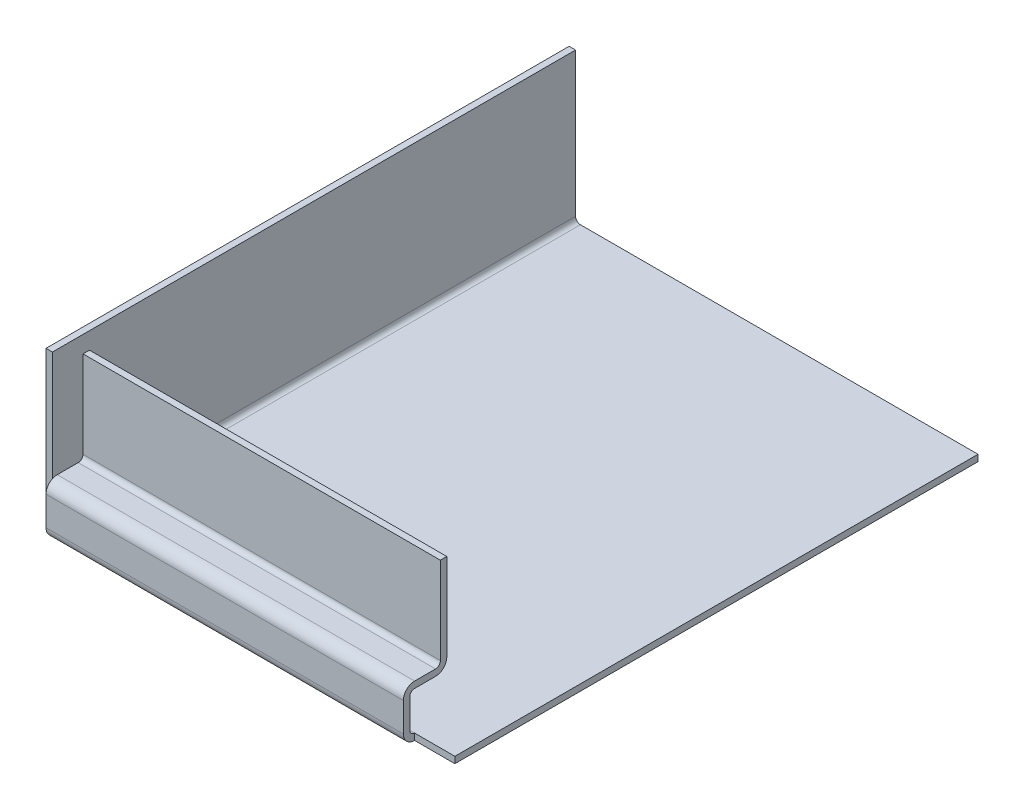
ISO-10303-21;
HEADER;
FILE_DESCRIPTION(('STEP AP214'),'2;1');
FILE_NAME('part.step','',(''),(''),'','','');
FILE_SCHEMA(('AUTOMOTIVE_DESIGN { 1 0 10303 214 1 1 1 1 }'));
ENDSEC;
DATA;
#1=APPLICATION_CONTEXT('core data for automotive mechanical design processes');
#2=APPLICATION_PROTOCOL_DEFINITION('international standard','automotive_design',2000,#1);
#3=PRODUCT_CONTEXT('',#1,'mechanical');
#4=PRODUCT('Part','Part','',(#3));
#5=PRODUCT_RELATED_PRODUCT_CATEGORY('part','',(#4));
#6=PRODUCT_DEFINITION_FORMATION('','',#4);
#7=PRODUCT_DEFINITION_CONTEXT('part definition',#1,'design');
#8=PRODUCT_DEFINITION('design','',#6,#7);
#9=PRODUCT_DEFINITION_SHAPE('','',#8);
#10=(LENGTH_UNIT() NAMED_UNIT(*) SI_UNIT(.MILLI.,.METRE.));
#11=(NAMED_UNIT(*) PLANE_ANGLE_UNIT() SI_UNIT($,.RADIAN.));
#12=(NAMED_UNIT(*) SI_UNIT($,.STERADIAN.) SOLID_ANGLE_UNIT());
#13=UNCERTAINTY_MEASURE_WITH_UNIT(LENGTH_MEASURE(1.E-05),#10,'distance_accuracy_value','');
#14=(GEOMETRIC_REPRESENTATION_CONTEXT(3) GLOBAL_UNCERTAINTY_ASSIGNED_CONTEXT((#13)) GLOBAL_UNIT_ASSIGNED_CONTEXT((#10,
#11,#12)) REPRESENTATION_CONTEXT('',''));
#15=CARTESIAN_POINT('',(0.,0.,0.));
#16=DIRECTION('',(0.,0.,1.));
#17=DIRECTION('',(1.,0.,0.));
#18=AXIS2_PLACEMENT_3D('',#15,#16,#17);
#19=CARTESIAN_POINT('',(0.,0.,57.));
#20=DIRECTION('',(0.,0.,1.));
#21=DIRECTION('',(0.,-1.,0.));
#22=AXIS2_PLACEMENT_3D('',#19,#20,#21);
#23=PLANE('',#22);
#24=DIRECTION('',(0.,1.,0.));
#25=VECTOR('',#24,1.);
#26=CARTESIAN_POINT('',(1.2,-2.99999999999996,57.));
#27=LINE('',#26,#25);
#28=CARTESIAN_POINT('',(1.20000000000001,-24.6,57.));
#29=VERTEX_POINT('',#28);
#30=CARTESIAN_POINT('',(1.20000000000001,-2.99999999999996,57.));
#31=VERTEX_POINT('',#30);
#32=EDGE_CURVE('E162',#29,#31,#27,.T.);
#33=ORIENTED_EDGE('',*,*,#32,.T.);
#34=DIRECTION('',(1.,0.,0.));
#35=VECTOR('',#34,1.);
#36=CARTESIAN_POINT('',(90.,-2.99999999999996,57.));
#37=LINE('',#36,#35);
#38=CARTESIAN_POINT('',(90.,-2.99999999999996,57.));
#39=VERTEX_POINT('',#38);
#40=EDGE_CURVE('E189',#31,#39,#37,.T.);
#41=ORIENTED_EDGE('',*,*,#40,.T.);
#42=DIRECTION('',(0.,1.,0.));
#43=VECTOR('',#42,1.);
#44=CARTESIAN_POINT('',(90.,-25.8,57.));
#45=LINE('',#44,#43);
#46=CARTESIAN_POINT('',(90.,-24.6,57.));
#47=VERTEX_POINT('',#46);
#48=EDGE_CURVE('E200',#39,#47,#45,.F.);
#49=ORIENTED_EDGE('',*,*,#48,.T.);
#50=DIRECTION('',(-1.,0.,0.));
#51=VECTOR('',#50,1.);
#52=CARTESIAN_POINT('',(1.20000000000001,-24.6,57.));
#53=LINE('',#52,#51);
#54=EDGE_CURVE('E167',#29,#47,#53,.F.);
#55=ORIENTED_EDGE('',*,*,#54,.F.);
#56=EDGE_LOOP('',(#33,#41,#49,#55));
#57=FACE_BOUND('',#56,.T.);
#58=ADVANCED_FACE('F17',(#57),#23,.F.);
#59=CARTESIAN_POINT('',(90.,-2.99999999999996,57.));
#60=DIRECTION('',(0.,-1.,0.));
#61=DIRECTION('',(0.,0.,-1.));
#62=AXIS2_PLACEMENT_3D('',#59,#60,#61);
#63=PLANE('',#62);
#64=DIRECTION('',(0.,0.,-1.));
#65=VECTOR('',#64,1.);
#66=CARTESIAN_POINT('',(90.,-2.99999999999996,57.));
#67=LINE('',#66,#65);
#68=CARTESIAN_POINT('',(90.,-2.99999999999996,58.6));
#69=VERTEX_POINT('',#68);
#70=EDGE_CURVE('E186',#39,#69,#67,.F.);
#71=ORIENTED_EDGE('',*,*,#70,.F.);
#72=ORIENTED_EDGE('',*,*,#40,.F.);
#73=DIRECTION('',(0.,0.,-1.));
#74=VECTOR('',#73,1.);
#75=CARTESIAN_POINT('',(1.20000000000001,-2.99999999999996,57.));
#76=LINE('',#75,#74);
#77=CARTESIAN_POINT('',(1.20000000000001,-2.99999999999996,58.6));
#78=VERTEX_POINT('',#77);
#79=EDGE_CURVE('E198',#78,#31,#76,.T.);
#80=ORIENTED_EDGE('',*,*,#79,.F.);
#81=DIRECTION('',(1.,0.,0.));
#82=VECTOR('',#81,1.);
#83=CARTESIAN_POINT('',(0.,-2.99999999999996,58.6));
#84=LINE('',#83,#82);
#85=EDGE_CURVE('E192',#69,#78,#84,.F.);
#86=ORIENTED_EDGE('',*,*,#85,.F.);
#87=EDGE_LOOP('',(#71,#72,#80,#86));
#88=FACE_BOUND('',#87,.T.);
#89=ADVANCED_FACE('F271',(#88),#63,.F.);
#90=CARTESIAN_POINT('',(1.20000000000001,-24.6,59.8));
#91=DIRECTION('',(-1.,0.,0.));
#92=DIRECTION('',(0.,0.,1.));
#93=AXIS2_PLACEMENT_3D('',#90,#91,#92);
#94=CYLINDRICAL_SURFACE('',#93,2.8);
#95=ORIENTED_EDGE('',*,*,#54,.T.);
#96=CARTESIAN_POINT('',(90.,-24.6,59.8));
#97=DIRECTION('',(-1.,0.,0.));
#98=DIRECTION('',(0.,0.,1.));
#99=AXIS2_PLACEMENT_3D('',#96,#97,#98);
#100=CIRCLE('',#99,2.8);
#101=CARTESIAN_POINT('',(90.,-27.4,59.8));
#102=VERTEX_POINT('',#101);
#103=EDGE_CURVE('E171',#102,#47,#100,.F.);
#104=ORIENTED_EDGE('',*,*,#103,.F.);
#105=DIRECTION('',(1.,0.,0.));
#106=VECTOR('',#105,1.);
#107=CARTESIAN_POINT('',(0.,-27.4,59.8));
#108=LINE('',#107,#106);
#109=CARTESIAN_POINT('',(1.20000000000001,-27.4,59.8));
#110=VERTEX_POINT('',#109);
#111=EDGE_CURVE('E169',#102,#110,#108,.F.);
#112=ORIENTED_EDGE('',*,*,#111,.T.);
#113=CARTESIAN_POINT('',(1.20000000000001,-24.6,59.8));
#114=DIRECTION('',(-1.,0.,0.));
#115=DIRECTION('',(0.,0.,1.));
#116=AXIS2_PLACEMENT_3D('',#113,#114,#115);
#117=CIRCLE('',#116,2.8);
#118=EDGE_CURVE('E20',#110,#29,#117,.F.);
#119=ORIENTED_EDGE('',*,*,#118,.T.);
#120=EDGE_LOOP('',(#95,#104,#112,#119));
#121=FACE_BOUND('',#120,.T.);
#122=ADVANCED_FACE('F170',(#121),#94,.T.);
#123=CARTESIAN_POINT('',(0.,0.,58.6));
#124=DIRECTION('',(0.,0.,1.));
#125=DIRECTION('',(0.,-1.,0.));
#126=AXIS2_PLACEMENT_3D('',#123,#124,#125);
#127=PLANE('',#126);
#128=DIRECTION('',(0.,-1.,0.));
#129=VECTOR('',#128,1.);
#130=CARTESIAN_POINT('',(90.,0.,58.6));
#131=LINE('',#130,#129);
#132=CARTESIAN_POINT('',(90.,-24.6,58.6));
#133=VERTEX_POINT('',#132);
#134=EDGE_CURVE('E195',#133,#69,#131,.F.);
#135=ORIENTED_EDGE('',*,*,#134,.T.);
#136=ORIENTED_EDGE('',*,*,#85,.T.);
#137=DIRECTION('',(0.,-1.,0.));
#138=VECTOR('',#137,1.);
#139=CARTESIAN_POINT('',(1.20000000000001,0.,58.6));
#140=LINE('',#139,#138);
#141=CARTESIAN_POINT('',(1.20000000000001,-24.6,58.6));
#142=VERTEX_POINT('',#141);
#143=EDGE_CURVE('E166',#78,#142,#140,.T.);
#144=ORIENTED_EDGE('',*,*,#143,.T.);
#145=DIRECTION('',(-1.,0.,0.));
#146=VECTOR('',#145,1.);
#147=CARTESIAN_POINT('',(1.20000000000001,-24.6,58.6));
#148=LINE('',#147,#146);
#149=EDGE_CURVE('E261',#142,#133,#148,.F.);
#150=ORIENTED_EDGE('',*,*,#149,.T.);
#151=EDGE_LOOP('',(#135,#136,#144,#150));
#152=FACE_BOUND('',#151,.T.);
#153=ADVANCED_FACE('F447',(#152),#127,.T.);
#154=CARTESIAN_POINT('',(0.,-27.3999999999998,0.));
#155=DIRECTION('',(0.,1.,0.));
#156=DIRECTION('',(0.,0.,1.));
#157=AXIS2_PLACEMENT_3D('',#154,#155,#156);
#158=PLANE('',#157);
#159=DIRECTION('',(0.,0.,1.));
#160=VECTOR('',#159,1.);
#161=CARTESIAN_POINT('',(1.2,-27.4,59.8));
#162=LINE('',#161,#160);
#163=CARTESIAN_POINT('',(1.20000000000001,-27.4,65.));
#164=VERTEX_POINT('',#163);
#165=EDGE_CURVE('E159',#110,#164,#162,.T.);
#166=ORIENTED_EDGE('',*,*,#165,.F.);
#167=ORIENTED_EDGE('',*,*,#111,.F.);
#168=DIRECTION('',(0.,0.,-1.));
#169=VECTOR('',#168,1.);
#170=CARTESIAN_POINT('',(90.,-27.4,66.2));
#171=LINE('',#170,#169);
#172=CARTESIAN_POINT('',(90.,-27.4,65.));
#173=VERTEX_POINT('',#172);
#174=EDGE_CURVE('E179',#173,#102,#171,.T.);
#175=ORIENTED_EDGE('',*,*,#174,.F.);
#176=DIRECTION('',(1.,0.,0.));
#177=VECTOR('',#176,1.);
#178=CARTESIAN_POINT('',(90.,-27.4,65.));
#179=LINE('',#178,#177);
#180=EDGE_CURVE('E178',#173,#164,#179,.F.);
#181=ORIENTED_EDGE('',*,*,#180,.T.);
#182=EDGE_LOOP('',(#166,#167,#175,#181));
#183=FACE_BOUND('',#182,.T.);
#184=ADVANCED_FACE('F177',(#183),#158,.F.);
#185=CARTESIAN_POINT('',(1.20000000000001,-24.6,59.8));
#186=DIRECTION('',(-1.,0.,0.));
#187=DIRECTION('',(0.,0.,1.));
#188=AXIS2_PLACEMENT_3D('',#185,#186,#187);
#189=CYLINDRICAL_SURFACE('',#188,1.2);
#190=CARTESIAN_POINT('',(90.,-24.6,59.8));
#191=DIRECTION('',(-1.,0.,0.));
#192=DIRECTION('',(0.,0.,1.));
#193=AXIS2_PLACEMENT_3D('',#190,#191,#192);
#194=CIRCLE('',#193,1.2);
#195=CARTESIAN_POINT('',(90.,-25.8,59.8));
#196=VERTEX_POINT('',#195);
#197=EDGE_CURVE('E258',#133,#196,#194,.T.);
#198=ORIENTED_EDGE('',*,*,#197,.F.);
#199=ORIENTED_EDGE('',*,*,#149,.F.);
#200=CARTESIAN_POINT('',(1.20000000000001,-24.6,59.8));
#201=DIRECTION('',(-1.,0.,0.));
#202=DIRECTION('',(0.,0.,1.));
#203=AXIS2_PLACEMENT_3D('',#200,#201,#202);
#204=CIRCLE('',#203,1.2);
#205=CARTESIAN_POINT('',(1.20000000000001,-25.8,59.8));
#206=VERTEX_POINT('',#205);
#207=EDGE_CURVE('E181',#206,#142,#204,.F.);
#208=ORIENTED_EDGE('',*,*,#207,.F.);
#209=DIRECTION('',(1.,0.,0.));
#210=VECTOR('',#209,1.);
#211=CARTESIAN_POINT('',(0.,-25.8,59.8));
#212=LINE('',#211,#210);
#213=EDGE_CURVE('E253',#196,#206,#212,.F.);
#214=ORIENTED_EDGE('',*,*,#213,.F.);
#215=EDGE_LOOP('',(#198,#199,#208,#214));
#216=FACE_BOUND('',#215,.T.);
#217=ADVANCED_FACE('F446',(#216),#189,.F.);
#218=CARTESIAN_POINT('',(90.,-28.6,65.));
#219=DIRECTION('',(1.,0.,0.));
#220=DIRECTION('',(0.,0.,-1.));
#221=AXIS2_PLACEMENT_3D('',#218,#219,#220);
#222=CYLINDRICAL_SURFACE('',#221,1.2);
#223=CARTESIAN_POINT('',(1.20000000000001,-28.6,65.));
#224=DIRECTION('',(1.,0.,0.));
#225=DIRECTION('',(0.,0.,-1.));
#226=AXIS2_PLACEMENT_3D('',#223,#224,#225);
#227=CIRCLE('',#226,1.2);
#228=CARTESIAN_POINT('',(1.20000000000001,-28.6,66.2));
#229=VERTEX_POINT('',#228);
#230=EDGE_CURVE('E250',#164,#229,#227,.T.);
#231=ORIENTED_EDGE('',*,*,#230,.F.);
#232=ORIENTED_EDGE('',*,*,#180,.F.);
#233=CARTESIAN_POINT('',(90.,-28.6,65.));
#234=DIRECTION('',(1.,0.,0.));
#235=DIRECTION('',(0.,0.,-1.));
#236=AXIS2_PLACEMENT_3D('',#233,#234,#235);
#237=CIRCLE('',#236,1.2);
#238=CARTESIAN_POINT('',(90.,-28.6,66.2));
#239=VERTEX_POINT('',#238);
#240=EDGE_CURVE('E254',#173,#239,#237,.T.);
#241=ORIENTED_EDGE('',*,*,#240,.T.);
#242=DIRECTION('',(-1.,0.,0.));
#243=VECTOR('',#242,1.);
#244=CARTESIAN_POINT('',(0.,-28.6,66.2));
#245=LINE('',#244,#243);
#246=EDGE_CURVE('E252',#229,#239,#245,.F.);
#247=ORIENTED_EDGE('',*,*,#246,.F.);
#248=EDGE_LOOP('',(#231,#232,#241,#247));
#249=FACE_BOUND('',#248,.T.);
#250=ADVANCED_FACE('F432',(#249),#222,.F.);
#251=CARTESIAN_POINT('',(0.,-25.7999999999998,0.));
#252=DIRECTION('',(0.,1.,0.));
#253=DIRECTION('',(0.,0.,1.));
#254=AXIS2_PLACEMENT_3D('',#251,#252,#253);
#255=PLANE('',#254);
#256=DIRECTION('',(0.,0.,1.));
#257=VECTOR('',#256,1.);
#258=CARTESIAN_POINT('',(90.,-25.7999999999998,0.));
#259=LINE('',#258,#257);
#260=CARTESIAN_POINT('',(90.,-25.8,65.));
#261=VERTEX_POINT('',#260);
#262=EDGE_CURVE('E287',#261,#196,#259,.F.);
#263=ORIENTED_EDGE('',*,*,#262,.T.);
#264=ORIENTED_EDGE('',*,*,#213,.T.);
#265=DIRECTION('',(0.,0.,1.));
#266=VECTOR('',#265,1.);
#267=CARTESIAN_POINT('',(1.20000000000001,-25.7999999999998,0.));
#268=LINE('',#267,#266);
#269=CARTESIAN_POINT('',(1.20000000000001,-25.8,65.));
#270=VERTEX_POINT('',#269);
#271=EDGE_CURVE('E257',#206,#270,#268,.T.);
#272=ORIENTED_EDGE('',*,*,#271,.T.);
#273=DIRECTION('',(1.,0.,0.));
#274=VECTOR('',#273,1.);
#275=CARTESIAN_POINT('',(90.,-25.8,65.));
#276=LINE('',#275,#274);
#277=EDGE_CURVE('E246',#261,#270,#276,.F.);
#278=ORIENTED_EDGE('',*,*,#277,.F.);
#279=EDGE_LOOP('',(#263,#264,#272,#278));
#280=FACE_BOUND('',#279,.T.);
#281=ADVANCED_FACE('F442',(#280),#255,.T.);
#282=CARTESIAN_POINT('',(0.,0.,65.));
#283=DIRECTION('',(1.,0.,0.));
#284=DIRECTION('',(0.,1.,0.));
#285=AXIS2_PLACEMENT_3D('',#282,#283,#284);
#286=PLANE('',#285);
#287=DIRECTION('',(0.,1.,0.));
#288=VECTOR('',#287,1.);
#289=CARTESIAN_POINT('',(0.,-35.8,65.));
#290=LINE('',#289,#288);
#291=CARTESIAN_POINT('',(0.,0.,65.));
#292=VERTEX_POINT('',#291);
#293=CARTESIAN_POINT('',(0.,-35.8,65.));
#294=VERTEX_POINT('',#293);
#295=EDGE_CURVE('E307',#292,#294,#290,.F.);
#296=ORIENTED_EDGE('',*,*,#295,.T.);
#297=DIRECTION('',(0.,0.,-1.));
#298=VECTOR('',#297,1.);
#299=CARTESIAN_POINT('',(0.,-35.8,65.));
#300=LINE('',#299,#298);
#301=CARTESIAN_POINT('',(0.,-35.8,-65.));
#302=VERTEX_POINT('',#301);
#303=EDGE_CURVE('E311',#294,#302,#300,.T.);
#304=ORIENTED_EDGE('',*,*,#303,.T.);
#305=DIRECTION('',(0.,1.,0.));
#306=VECTOR('',#305,1.);
#307=CARTESIAN_POINT('',(0.,-38.6,-65.));
#308=LINE('',#307,#306);
#309=CARTESIAN_POINT('',(0.,0.,-65.));
#310=VERTEX_POINT('',#309);
#311=EDGE_CURVE('E305',#310,#302,#308,.F.);
#312=ORIENTED_EDGE('',*,*,#311,.F.);
#313=DIRECTION('',(0.,0.,1.));
#314=VECTOR('',#313,1.);
#315=CARTESIAN_POINT('',(0.,0.,65.));
#316=LINE('',#315,#314);
#317=EDGE_CURVE('E291',#292,#310,#316,.F.);
#318=ORIENTED_EDGE('',*,*,#317,.F.);
#319=EDGE_LOOP('',(#296,#304,#312,#318));
#320=FACE_BOUND('',#319,.T.);
#321=ADVANCED_FACE('F411',(#320),#286,.T.);
#322=CARTESIAN_POINT('',(0.,0.,66.2));
#323=DIRECTION('',(0.,0.,-1.));
#324=DIRECTION('',(-1.,0.,0.));
#325=AXIS2_PLACEMENT_3D('',#322,#323,#324);
#326=PLANE('',#325);
#327=DIRECTION('',(0.,1.,0.));
#328=VECTOR('',#327,1.);
#329=CARTESIAN_POINT('',(1.2,-37.,66.2));
#330=LINE('',#329,#328);
#331=CARTESIAN_POINT('',(1.20000000000001,-35.8,66.2));
#332=VERTEX_POINT('',#331);
#333=EDGE_CURVE('E249',#332,#229,#330,.T.);
#334=ORIENTED_EDGE('',*,*,#333,.T.);
#335=ORIENTED_EDGE('',*,*,#246,.T.);
#336=DIRECTION('',(0.,1.,0.));
#337=VECTOR('',#336,1.);
#338=CARTESIAN_POINT('',(90.,-28.6,66.2));
#339=LINE('',#338,#337);
#340=CARTESIAN_POINT('',(90.,-35.8,66.2));
#341=VERTEX_POINT('',#340);
#342=EDGE_CURVE('E245',#239,#341,#339,.F.);
#343=ORIENTED_EDGE('',*,*,#342,.T.);
#344=DIRECTION('',(1.,0.,0.));
#345=VECTOR('',#344,1.);
#346=CARTESIAN_POINT('',(90.,-35.8,66.2));
#347=LINE('',#346,#345);
#348=EDGE_CURVE('E242',#341,#332,#347,.F.);
#349=ORIENTED_EDGE('',*,*,#348,.T.);
#350=EDGE_LOOP('',(#334,#335,#343,#349));
#351=FACE_BOUND('',#350,.T.);
#352=ADVANCED_FACE('F430',(#351),#326,.T.);
#353=CARTESIAN_POINT('',(-1.6,0.,65.));
#354=DIRECTION('',(0.,1.,0.));
#355=DIRECTION('',(-1.,0.,0.));
#356=AXIS2_PLACEMENT_3D('',#353,#354,#355);
#357=PLANE('',#356);
#358=DIRECTION('',(-1.,0.,0.));
#359=VECTOR('',#358,1.);
#360=CARTESIAN_POINT('',(1.2,0.,65.));
#361=LINE('',#360,#359);
#362=CARTESIAN_POINT('',(-1.6,0.,65.));
#363=VERTEX_POINT('',#362);
#364=EDGE_CURVE('E293',#363,#292,#361,.F.);
#365=ORIENTED_EDGE('',*,*,#364,.T.);
#366=ORIENTED_EDGE('',*,*,#317,.T.);
#367=DIRECTION('',(-1.,0.,0.));
#368=VECTOR('',#367,1.);
#369=CARTESIAN_POINT('',(1.2,0.,-65.));
#370=LINE('',#369,#368);
#371=CARTESIAN_POINT('',(-1.6,0.,-65.));
#372=VERTEX_POINT('',#371);
#373=EDGE_CURVE('E296',#372,#310,#370,.F.);
#374=ORIENTED_EDGE('',*,*,#373,.F.);
#375=DIRECTION('',(0.,0.,1.));
#376=VECTOR('',#375,1.);
#377=CARTESIAN_POINT('',(-1.6,0.,65.));
#378=LINE('',#377,#376);
#379=EDGE_CURVE('E239',#372,#363,#378,.T.);
#380=ORIENTED_EDGE('',*,*,#379,.T.);
#381=EDGE_LOOP('',(#365,#366,#374,#380));
#382=FACE_BOUND('',#381,.T.);
#383=ADVANCED_FACE('F408',(#382),#357,.T.);
#384=CARTESIAN_POINT('',(90.,-28.6,65.));
#385=DIRECTION('',(1.,0.,0.));
#386=DIRECTION('',(0.,0.,-1.));
#387=AXIS2_PLACEMENT_3D('',#384,#385,#386);
#388=CYLINDRICAL_SURFACE('',#387,2.8);
#389=ORIENTED_EDGE('',*,*,#277,.T.);
#390=CARTESIAN_POINT('',(1.20000000000001,-28.6,65.));
#391=DIRECTION('',(1.,0.,0.));
#392=DIRECTION('',(0.,0.,-1.));
#393=AXIS2_PLACEMENT_3D('',#390,#391,#392);
#394=CIRCLE('',#393,2.8);
#395=CARTESIAN_POINT('',(1.20000000000001,-28.6,67.8));
#396=VERTEX_POINT('',#395);
#397=EDGE_CURVE('E243',#270,#396,#394,.T.);
#398=ORIENTED_EDGE('',*,*,#397,.T.);
#399=DIRECTION('',(-1.,0.,0.));
#400=VECTOR('',#399,1.);
#401=CARTESIAN_POINT('',(0.,-28.6,67.8));
#402=LINE('',#401,#400);
#403=CARTESIAN_POINT('',(90.,-28.6,67.8));
#404=VERTEX_POINT('',#403);
#405=EDGE_CURVE('E336',#396,#404,#402,.F.);
#406=ORIENTED_EDGE('',*,*,#405,.T.);
#407=CARTESIAN_POINT('',(90.,-28.6,65.));
#408=DIRECTION('',(1.,0.,0.));
#409=DIRECTION('',(0.,0.,-1.));
#410=AXIS2_PLACEMENT_3D('',#407,#408,#409);
#411=CIRCLE('',#410,2.8);
#412=EDGE_CURVE('E247',#404,#261,#411,.F.);
#413=ORIENTED_EDGE('',*,*,#412,.T.);
#414=EDGE_LOOP('',(#389,#398,#406,#413));
#415=FACE_BOUND('',#414,.T.);
#416=ADVANCED_FACE('F438',(#415),#388,.T.);
#417=CARTESIAN_POINT('',(1.2,-35.8,65.));
#418=DIRECTION('',(0.,0.,-1.));
#419=DIRECTION('',(-1.,0.,0.));
#420=AXIS2_PLACEMENT_3D('',#417,#418,#419);
#421=CYLINDRICAL_SURFACE('',#420,1.2);
#422=ORIENTED_EDGE('',*,*,#303,.F.);
#423=CARTESIAN_POINT('',(1.2,-35.8,65.));
#424=DIRECTION('',(0.,0.,-1.));
#425=DIRECTION('',(-1.,0.,0.));
#426=AXIS2_PLACEMENT_3D('',#423,#424,#425);
#427=CIRCLE('',#426,1.2);
#428=CARTESIAN_POINT('',(1.20000000000001,-37.,65.));
#429=VERTEX_POINT('',#428);
#430=EDGE_CURVE('E236',#429,#294,#427,.T.);
#431=ORIENTED_EDGE('',*,*,#430,.F.);
#432=DIRECTION('',(0.,0.,1.));
#433=VECTOR('',#432,1.);
#434=CARTESIAN_POINT('',(1.2,-37.,65.));
#435=LINE('',#434,#433);
#436=CARTESIAN_POINT('',(1.2,-37.,-65.));
#437=VERTEX_POINT('',#436);
#438=EDGE_CURVE('E341',#437,#429,#435,.T.);
#439=ORIENTED_EDGE('',*,*,#438,.F.);
#440=CARTESIAN_POINT('',(1.2,-35.8,-65.));
#441=DIRECTION('',(0.,0.,-1.));
#442=DIRECTION('',(-1.,0.,0.));
#443=AXIS2_PLACEMENT_3D('',#440,#441,#442);
#444=CIRCLE('',#443,1.2);
#445=EDGE_CURVE('E240',#302,#437,#444,.F.);
#446=ORIENTED_EDGE('',*,*,#445,.F.);
#447=EDGE_LOOP('',(#422,#431,#439,#446));
#448=FACE_BOUND('',#447,.T.);
#449=ADVANCED_FACE('F418',(#448),#421,.F.);
#450=CARTESIAN_POINT('',(90.,-35.8,65.));
#451=DIRECTION('',(1.,0.,0.));
#452=DIRECTION('',(0.,0.,-1.));
#453=AXIS2_PLACEMENT_3D('',#450,#451,#452);
#454=CYLINDRICAL_SURFACE('',#453,1.19999999999999);
#455=CARTESIAN_POINT('',(1.20000000000001,-35.8,65.));
#456=DIRECTION('',(1.,0.,0.));
#457=DIRECTION('',(0.,0.,-1.));
#458=AXIS2_PLACEMENT_3D('',#455,#456,#457);
#459=CIRCLE('',#458,1.19999999999999);
#460=EDGE_CURVE('E227',#332,#429,#459,.T.);
#461=ORIENTED_EDGE('',*,*,#460,.F.);
#462=ORIENTED_EDGE('',*,*,#348,.F.);
#463=CARTESIAN_POINT('',(90.,-35.8,65.));
#464=DIRECTION('',(1.,0.,0.));
#465=DIRECTION('',(0.,0.,-1.));
#466=AXIS2_PLACEMENT_3D('',#463,#464,#465);
#467=CIRCLE('',#466,1.19999999999999);
#468=CARTESIAN_POINT('',(90.,-37.,65.));
#469=VERTEX_POINT('',#468);
#470=EDGE_CURVE('E231',#341,#469,#467,.T.);
#471=ORIENTED_EDGE('',*,*,#470,.T.);
#472=DIRECTION('',(1.,0.,0.));
#473=VECTOR('',#472,1.);
#474=CARTESIAN_POINT('',(0.,-37.,65.));
#475=LINE('',#474,#473);
#476=EDGE_CURVE('E226',#429,#469,#475,.T.);
#477=ORIENTED_EDGE('',*,*,#476,.F.);
#478=EDGE_LOOP('',(#461,#462,#471,#477));
#479=FACE_BOUND('',#478,.T.);
#480=ADVANCED_FACE('F427',(#479),#454,.F.);
#481=CARTESIAN_POINT('',(1.2,-37.,65.));
#482=DIRECTION('',(0.,0.,1.));
#483=DIRECTION('',(1.,0.,0.));
#484=AXIS2_PLACEMENT_3D('',#481,#482,#483);
#485=PLANE('',#484);
#486=ORIENTED_EDGE('',*,*,#430,.T.);
#487=ORIENTED_EDGE('',*,*,#295,.F.);
#488=ORIENTED_EDGE('',*,*,#364,.F.);
#489=DIRECTION('',(0.,1.,0.));
#490=VECTOR('',#489,1.);
#491=CARTESIAN_POINT('',(-1.6,0.,65.));
#492=LINE('',#491,#490);
#493=CARTESIAN_POINT('',(-1.6,-35.8,65.));
#494=VERTEX_POINT('',#493);
#495=EDGE_CURVE('E326',#363,#494,#492,.F.);
#496=ORIENTED_EDGE('',*,*,#495,.T.);
#497=CARTESIAN_POINT('',(1.2,-35.8,65.));
#498=DIRECTION('',(0.,0.,-1.));
#499=DIRECTION('',(-1.,0.,0.));
#500=AXIS2_PLACEMENT_3D('',#497,#498,#499);
#501=CIRCLE('',#500,2.8);
#502=CARTESIAN_POINT('',(1.20000000000001,-38.6,65.));
#503=VERTEX_POINT('',#502);
#504=EDGE_CURVE('E222',#503,#494,#501,.T.);
#505=ORIENTED_EDGE('',*,*,#504,.F.);
#506=DIRECTION('',(0.,1.,0.));
#507=VECTOR('',#506,1.);
#508=CARTESIAN_POINT('',(1.20000000000001,-35.8,65.));
#509=LINE('',#508,#507);
#510=EDGE_CURVE('E229',#429,#503,#509,.F.);
#511=ORIENTED_EDGE('',*,*,#510,.F.);
#512=EDGE_LOOP('',(#486,#487,#488,#496,#505,#511));
#513=FACE_BOUND('',#512,.T.);
#514=ADVANCED_FACE('F413',(#513),#485,.T.);
#515=CARTESIAN_POINT('',(-1.6,0.,65.));
#516=DIRECTION('',(1.,0.,0.));
#517=DIRECTION('',(0.,1.,0.));
#518=AXIS2_PLACEMENT_3D('',#515,#516,#517);
#519=PLANE('',#518);
#520=DIRECTION('',(0.,0.,-1.));
#521=VECTOR('',#520,1.);
#522=CARTESIAN_POINT('',(-1.6,-35.8,65.));
#523=LINE('',#522,#521);
#524=CARTESIAN_POINT('',(-1.6,-35.8,-65.));
#525=VERTEX_POINT('',#524);
#526=EDGE_CURVE('E221',#494,#525,#523,.T.);
#527=ORIENTED_EDGE('',*,*,#526,.F.);
#528=ORIENTED_EDGE('',*,*,#495,.F.);
#529=ORIENTED_EDGE('',*,*,#379,.F.);
#530=DIRECTION('',(0.,1.,0.));
#531=VECTOR('',#530,1.);
#532=CARTESIAN_POINT('',(-1.6,0.,-65.));
#533=LINE('',#532,#531);
#534=EDGE_CURVE('E348',#525,#372,#533,.T.);
#535=ORIENTED_EDGE('',*,*,#534,.F.);
#536=EDGE_LOOP('',(#527,#528,#529,#535));
#537=FACE_BOUND('',#536,.T.);
#538=ADVANCED_FACE('F405',(#537),#519,.F.);
#539=CARTESIAN_POINT('',(90.,-35.8,65.));
#540=DIRECTION('',(-1.,0.,0.));
#541=DIRECTION('',(0.,0.,1.));
#542=AXIS2_PLACEMENT_3D('',#539,#540,#541);
#543=PLANE('',#542);
#544=ORIENTED_EDGE('',*,*,#470,.F.);
#545=ORIENTED_EDGE('',*,*,#342,.F.);
#546=ORIENTED_EDGE('',*,*,#240,.F.);
#547=ORIENTED_EDGE('',*,*,#174,.T.);
#548=ORIENTED_EDGE('',*,*,#103,.T.);
#549=ORIENTED_EDGE('',*,*,#48,.F.);
#550=ORIENTED_EDGE('',*,*,#70,.T.);
#551=ORIENTED_EDGE('',*,*,#134,.F.);
#552=ORIENTED_EDGE('',*,*,#197,.T.);
#553=ORIENTED_EDGE('',*,*,#262,.F.);
#554=ORIENTED_EDGE('',*,*,#412,.F.);
#555=DIRECTION('',(0.,1.,0.));
#556=VECTOR('',#555,1.);
#557=CARTESIAN_POINT('',(90.,0.,67.8));
#558=LINE('',#557,#556);
#559=CARTESIAN_POINT('',(90.,-35.8,67.8));
#560=VERTEX_POINT('',#559);
#561=EDGE_CURVE('E230',#404,#560,#558,.F.);
#562=ORIENTED_EDGE('',*,*,#561,.T.);
#563=CARTESIAN_POINT('',(90.,-35.8,65.));
#564=DIRECTION('',(1.,0.,0.));
#565=DIRECTION('',(0.,0.,-1.));
#566=AXIS2_PLACEMENT_3D('',#563,#564,#565);
#567=CIRCLE('',#566,2.8);
#568=CARTESIAN_POINT('',(90.,-38.6,65.));
#569=VERTEX_POINT('',#568);
#570=EDGE_CURVE('E219',#569,#560,#567,.F.);
#571=ORIENTED_EDGE('',*,*,#570,.F.);
#572=DIRECTION('',(0.,1.,0.));
#573=VECTOR('',#572,1.);
#574=CARTESIAN_POINT('',(90.,-35.8,65.));
#575=LINE('',#574,#573);
#576=EDGE_CURVE('E235',#469,#569,#575,.F.);
#577=ORIENTED_EDGE('',*,*,#576,.F.);
#578=EDGE_LOOP('',(#544,#545,#546,#547,#548,#549,#550,#551,#552,#553,#554,#562,#571,#577));
#579=FACE_BOUND('',#578,.T.);
#580=ADVANCED_FACE('F265',(#579),#543,.F.);
#581=CARTESIAN_POINT('',(0.,0.,67.8));
#582=DIRECTION('',(0.,0.,-1.));
#583=DIRECTION('',(-1.,0.,0.));
#584=AXIS2_PLACEMENT_3D('',#581,#582,#583);
#585=PLANE('',#584);
#586=ORIENTED_EDGE('',*,*,#561,.F.);
#587=ORIENTED_EDGE('',*,*,#405,.F.);
#588=DIRECTION('',(0.,1.,0.));
#589=VECTOR('',#588,1.);
#590=CARTESIAN_POINT('',(1.20000000000001,0.,67.8));
#591=LINE('',#590,#589);
#592=CARTESIAN_POINT('',(1.20000000000001,-35.8,67.8));
#593=VERTEX_POINT('',#592);
#594=EDGE_CURVE('E234',#593,#396,#591,.T.);
#595=ORIENTED_EDGE('',*,*,#594,.F.);
#596=DIRECTION('',(1.,0.,0.));
#597=VECTOR('',#596,1.);
#598=CARTESIAN_POINT('',(90.,-35.8,67.8));
#599=LINE('',#598,#597);
#600=EDGE_CURVE('E218',#560,#593,#599,.F.);
#601=ORIENTED_EDGE('',*,*,#600,.F.);
#602=EDGE_LOOP('',(#586,#587,#595,#601));
#603=FACE_BOUND('',#602,.T.);
#604=ADVANCED_FACE('F436',(#603),#585,.F.);
#605=CARTESIAN_POINT('',(1.20000000000001,-35.8,65.));
#606=DIRECTION('',(-1.,0.,0.));
#607=DIRECTION('',(0.,0.,1.));
#608=AXIS2_PLACEMENT_3D('',#605,#606,#607);
#609=PLANE('',#608);
#610=ORIENTED_EDGE('',*,*,#510,.T.);
#611=CARTESIAN_POINT('',(1.20000000000001,-35.8,65.));
#612=DIRECTION('',(1.,0.,0.));
#613=DIRECTION('',(0.,0.,-1.));
#614=AXIS2_PLACEMENT_3D('',#611,#612,#613);
#615=CIRCLE('',#614,2.8);
#616=EDGE_CURVE('E214',#593,#503,#615,.T.);
#617=ORIENTED_EDGE('',*,*,#616,.F.);
#618=ORIENTED_EDGE('',*,*,#594,.T.);
#619=ORIENTED_EDGE('',*,*,#397,.F.);
#620=ORIENTED_EDGE('',*,*,#271,.F.);
#621=ORIENTED_EDGE('',*,*,#207,.T.);
#622=ORIENTED_EDGE('',*,*,#143,.F.);
#623=ORIENTED_EDGE('',*,*,#79,.T.);
#624=ORIENTED_EDGE('',*,*,#32,.F.);
#625=ORIENTED_EDGE('',*,*,#118,.F.);
#626=ORIENTED_EDGE('',*,*,#165,.T.);
#627=ORIENTED_EDGE('',*,*,#230,.T.);
#628=ORIENTED_EDGE('',*,*,#333,.F.);
#629=ORIENTED_EDGE('',*,*,#460,.T.);
#630=EDGE_LOOP('',(#610,#617,#618,#619,#620,#621,#622,#623,#624,#625,#626,#627,#628,#629));
#631=FACE_BOUND('',#630,.T.);
#632=ADVANCED_FACE('F157',(#631),#609,.T.);
#633=CARTESIAN_POINT('',(0.,-37.,65.));
#634=DIRECTION('',(0.,1.,0.));
#635=DIRECTION('',(0.,0.,1.));
#636=AXIS2_PLACEMENT_3D('',#633,#634,#635);
#637=PLANE('',#636);
#638=DIRECTION('',(1.,0.,0.));
#639=VECTOR('',#638,1.);
#640=CARTESIAN_POINT('',(-1.6,-37.,65.));
#641=LINE('',#640,#639);
#642=CARTESIAN_POINT('',(100.,-37.,65.));
#643=VERTEX_POINT('',#642);
#644=EDGE_CURVE('E217',#643,#469,#641,.F.);
#645=ORIENTED_EDGE('',*,*,#644,.F.);
#646=DIRECTION('',(0.,0.,-1.));
#647=VECTOR('',#646,1.);
#648=CARTESIAN_POINT('',(100.,-37.,65.));
#649=LINE('',#648,#647);
#650=CARTESIAN_POINT('',(100.,-37.,-65.));
#651=VERTEX_POINT('',#650);
#652=EDGE_CURVE('E335',#651,#643,#649,.F.);
#653=ORIENTED_EDGE('',*,*,#652,.F.);
#654=DIRECTION('',(-1.,0.,0.));
#655=VECTOR('',#654,1.);
#656=CARTESIAN_POINT('',(1.2,-37.,-65.));
#657=LINE('',#656,#655);
#658=EDGE_CURVE('E308',#437,#651,#657,.F.);
#659=ORIENTED_EDGE('',*,*,#658,.F.);
#660=ORIENTED_EDGE('',*,*,#438,.T.);
#661=ORIENTED_EDGE('',*,*,#476,.T.);
#662=EDGE_LOOP('',(#645,#653,#659,#660,#661));
#663=FACE_BOUND('',#662,.T.);
#664=ADVANCED_FACE('F423',(#663),#637,.T.);
#665=CARTESIAN_POINT('',(1.2,-35.8,65.));
#666=DIRECTION('',(0.,0.,-1.));
#667=DIRECTION('',(-1.,0.,0.));
#668=AXIS2_PLACEMENT_3D('',#665,#666,#667);
#669=CYLINDRICAL_SURFACE('',#668,2.8);
#670=ORIENTED_EDGE('',*,*,#504,.T.);
#671=ORIENTED_EDGE('',*,*,#526,.T.);
#672=CARTESIAN_POINT('',(1.2,-35.8,-65.));
#673=DIRECTION('',(0.,0.,-1.));
#674=DIRECTION('',(-1.,0.,0.));
#675=AXIS2_PLACEMENT_3D('',#672,#673,#674);
#676=CIRCLE('',#675,2.8);
#677=CARTESIAN_POINT('',(1.2,-38.6,-65.));
#678=VERTEX_POINT('',#677);
#679=EDGE_CURVE('E224',#525,#678,#676,.F.);
#680=ORIENTED_EDGE('',*,*,#679,.T.);
#681=DIRECTION('',(0.,0.,1.));
#682=VECTOR('',#681,1.);
#683=CARTESIAN_POINT('',(1.2,-38.6,65.));
#684=LINE('',#683,#682);
#685=EDGE_CURVE('E366',#678,#503,#684,.T.);
#686=ORIENTED_EDGE('',*,*,#685,.T.);
#687=EDGE_LOOP('',(#670,#671,#680,#686));
#688=FACE_BOUND('',#687,.T.);
#689=ADVANCED_FACE('F398',(#688),#669,.T.);
#690=CARTESIAN_POINT('',(90.,-35.8,65.));
#691=DIRECTION('',(1.,0.,0.));
#692=DIRECTION('',(0.,0.,-1.));
#693=AXIS2_PLACEMENT_3D('',#690,#691,#692);
#694=CYLINDRICAL_SURFACE('',#693,2.8);
#695=ORIENTED_EDGE('',*,*,#600,.T.);
#696=ORIENTED_EDGE('',*,*,#616,.T.);
#697=DIRECTION('',(1.,0.,0.));
#698=VECTOR('',#697,1.);
#699=CARTESIAN_POINT('',(0.,-38.6,65.));
#700=LINE('',#699,#698);
#701=EDGE_CURVE('E360',#503,#569,#700,.T.);
#702=ORIENTED_EDGE('',*,*,#701,.T.);
#703=ORIENTED_EDGE('',*,*,#570,.T.);
#704=EDGE_LOOP('',(#695,#696,#702,#703));
#705=FACE_BOUND('',#704,.T.);
#706=ADVANCED_FACE('F394',(#705),#694,.T.);
#707=CARTESIAN_POINT('',(-1.6,-35.8,65.));
#708=DIRECTION('',(0.,0.,1.));
#709=DIRECTION('',(1.,0.,0.));
#710=AXIS2_PLACEMENT_3D('',#707,#708,#709);
#711=PLANE('',#710);
#712=DIRECTION('',(1.,0.,0.));
#713=VECTOR('',#712,1.);
#714=CARTESIAN_POINT('',(0.,-38.6,65.));
#715=LINE('',#714,#713);
#716=CARTESIAN_POINT('',(100.,-38.6,65.));
#717=VERTEX_POINT('',#716);
#718=EDGE_CURVE('E357',#569,#717,#715,.T.);
#719=ORIENTED_EDGE('',*,*,#718,.T.);
#720=DIRECTION('',(0.,1.,0.));
#721=VECTOR('',#720,1.);
#722=CARTESIAN_POINT('',(100.,-37.,65.));
#723=LINE('',#722,#721);
#724=EDGE_CURVE('E310',#643,#717,#723,.F.);
#725=ORIENTED_EDGE('',*,*,#724,.F.);
#726=ORIENTED_EDGE('',*,*,#644,.T.);
#727=ORIENTED_EDGE('',*,*,#576,.T.);
#728=EDGE_LOOP('',(#719,#725,#726,#727));
#729=FACE_BOUND('',#728,.T.);
#730=ADVANCED_FACE('F388',(#729),#711,.T.);
#731=CARTESIAN_POINT('',(100.,-37.,65.));
#732=DIRECTION('',(1.,0.,0.));
#733=DIRECTION('',(0.,0.,-1.));
#734=AXIS2_PLACEMENT_3D('',#731,#732,#733);
#735=PLANE('',#734);
#736=ORIENTED_EDGE('',*,*,#724,.T.);
#737=DIRECTION('',(0.,0.,1.));
#738=VECTOR('',#737,1.);
#739=CARTESIAN_POINT('',(100.,-38.6,65.));
#740=LINE('',#739,#738);
#741=CARTESIAN_POINT('',(100.,-38.6,-65.));
#742=VERTEX_POINT('',#741);
#743=EDGE_CURVE('E26',#717,#742,#740,.F.);
#744=ORIENTED_EDGE('',*,*,#743,.T.);
#745=DIRECTION('',(0.,1.,0.));
#746=VECTOR('',#745,1.);
#747=CARTESIAN_POINT('',(100.,-35.8,-65.));
#748=LINE('',#747,#746);
#749=EDGE_CURVE('E34',#651,#742,#748,.F.);
#750=ORIENTED_EDGE('',*,*,#749,.F.);
#751=ORIENTED_EDGE('',*,*,#652,.T.);
#752=EDGE_LOOP('',(#736,#744,#750,#751));
#753=FACE_BOUND('',#752,.T.);
#754=ADVANCED_FACE('F380',(#753),#735,.T.);
#755=CARTESIAN_POINT('',(1.2,-35.8,-65.));
#756=DIRECTION('',(0.,0.,-1.));
#757=DIRECTION('',(-1.,0.,0.));
#758=AXIS2_PLACEMENT_3D('',#755,#756,#757);
#759=PLANE('',#758);
#760=ORIENTED_EDGE('',*,*,#658,.T.);
#761=ORIENTED_EDGE('',*,*,#749,.T.);
#762=DIRECTION('',(1.,0.,0.));
#763=VECTOR('',#762,1.);
#764=CARTESIAN_POINT('',(0.,-38.6,-65.));
#765=LINE('',#764,#763);
#766=EDGE_CURVE('E11',#742,#678,#765,.F.);
#767=ORIENTED_EDGE('',*,*,#766,.T.);
#768=ORIENTED_EDGE('',*,*,#679,.F.);
#769=ORIENTED_EDGE('',*,*,#534,.T.);
#770=ORIENTED_EDGE('',*,*,#373,.T.);
#771=ORIENTED_EDGE('',*,*,#311,.T.);
#772=ORIENTED_EDGE('',*,*,#445,.T.);
#773=EDGE_LOOP('',(#760,#761,#767,#768,#769,#770,#771,#772));
#774=FACE_BOUND('',#773,.T.);
#775=ADVANCED_FACE('F401',(#774),#759,.T.);
#776=CARTESIAN_POINT('',(0.,-38.6,65.));
#777=DIRECTION('',(0.,1.,0.));
#778=DIRECTION('',(0.,0.,1.));
#779=AXIS2_PLACEMENT_3D('',#776,#777,#778);
#780=PLANE('',#779);
#781=ORIENTED_EDGE('',*,*,#743,.F.);
#782=ORIENTED_EDGE('',*,*,#718,.F.);
#783=ORIENTED_EDGE('',*,*,#701,.F.);
#784=ORIENTED_EDGE('',*,*,#685,.F.);
#785=ORIENTED_EDGE('',*,*,#766,.F.);
#786=EDGE_LOOP('',(#781,#782,#783,#784,#785));
#787=FACE_BOUND('',#786,.T.);
#788=ADVANCED_FACE('F384',(#787),#780,.F.);
#789=CLOSED_SHELL('',(#58,#89,#122,#153,#184,#217,#250,#281,#321,#352,#383,#416,#449,#480,#514,
#538,#580,#604,#632,#664,#689,#706,#730,#754,#775,#788));
#790=MANIFOLD_SOLID_BREP('B1',#789);
#791=ADVANCED_BREP_SHAPE_REPRESENTATION('',(#18,#790),#14);
#792=SHAPE_DEFINITION_REPRESENTATION(#9,#791);
ENDSEC;
END-ISO-10303-21;
